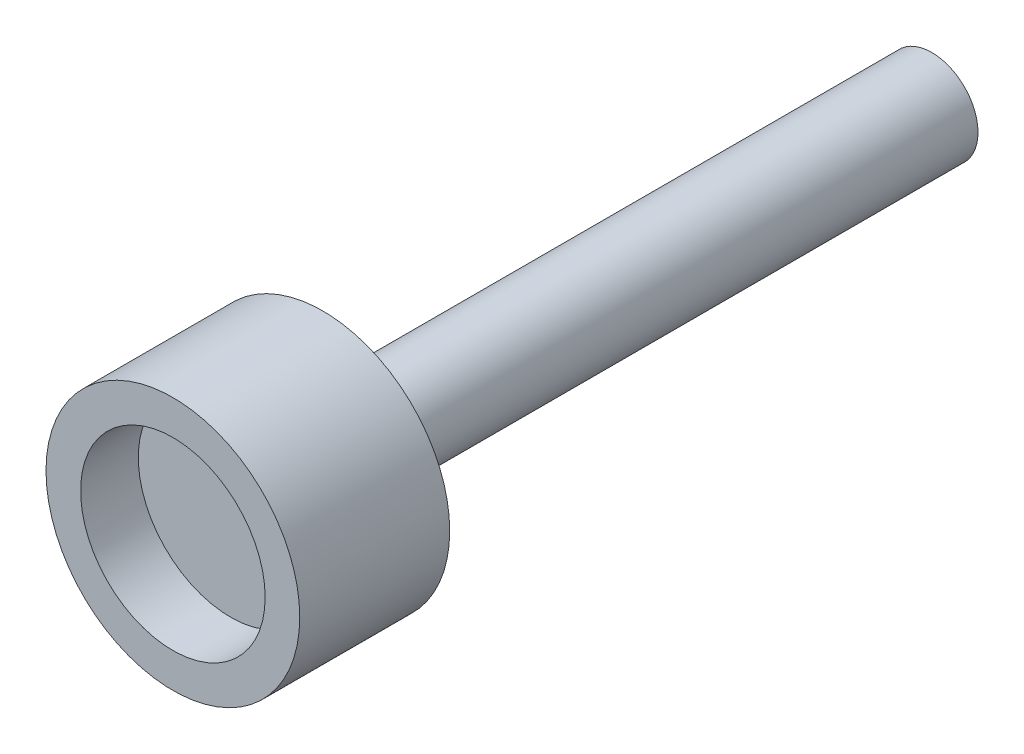
ISO-10303-21;
HEADER;
FILE_DESCRIPTION(('STEP AP214'),'2;1');
FILE_NAME('part.step','',(''),(''),'','','');
FILE_SCHEMA(('AUTOMOTIVE_DESIGN { 1 0 10303 214 1 1 1 1 }'));
ENDSEC;
DATA;
#1=APPLICATION_CONTEXT('core data for automotive mechanical design processes');
#2=APPLICATION_PROTOCOL_DEFINITION('international standard','automotive_design',2000,#1);
#3=PRODUCT_CONTEXT('',#1,'mechanical');
#4=PRODUCT('Part','Part','',(#3));
#5=PRODUCT_RELATED_PRODUCT_CATEGORY('part','',(#4));
#6=PRODUCT_DEFINITION_FORMATION('','',#4);
#7=PRODUCT_DEFINITION_CONTEXT('part definition',#1,'design');
#8=PRODUCT_DEFINITION('design','',#6,#7);
#9=PRODUCT_DEFINITION_SHAPE('','',#8);
#10=(LENGTH_UNIT() NAMED_UNIT(*) SI_UNIT(.MILLI.,.METRE.));
#11=(NAMED_UNIT(*) PLANE_ANGLE_UNIT() SI_UNIT($,.RADIAN.));
#12=(NAMED_UNIT(*) SI_UNIT($,.STERADIAN.) SOLID_ANGLE_UNIT());
#13=UNCERTAINTY_MEASURE_WITH_UNIT(LENGTH_MEASURE(1.E-05),#10,'distance_accuracy_value','');
#14=(GEOMETRIC_REPRESENTATION_CONTEXT(3) GLOBAL_UNCERTAINTY_ASSIGNED_CONTEXT((#13)) GLOBAL_UNIT_ASSIGNED_CONTEXT((#10,
#11,#12)) REPRESENTATION_CONTEXT('',''));
#15=CARTESIAN_POINT('',(0.,0.,0.));
#16=DIRECTION('',(0.,0.,1.));
#17=DIRECTION('',(1.,0.,0.));
#18=AXIS2_PLACEMENT_3D('',#15,#16,#17);
#19=CARTESIAN_POINT('',(0.,0.,13.));
#20=DIRECTION('',(0.,0.,-1.));
#21=DIRECTION('',(-1.,0.,0.));
#22=AXIS2_PLACEMENT_3D('',#19,#20,#21);
#23=CYLINDRICAL_SURFACE('',#22,11.);
#24=CARTESIAN_POINT('',(-11.,0.,6.5));
#25=CARTESIAN_POINT('',(-10.9999987467262,-0.0838384134298606,6.49999648054262));
#26=CARTESIAN_POINT('',(-10.9990314271488,-0.167727602289746,6.49294740732744));
#27=CARTESIAN_POINT('',(-10.9952656640845,-0.333167097641412,6.46494111677571));
#28=CARTESIAN_POINT('',(-10.992465364401,-0.414714945659857,6.44396980055016));
#29=CARTESIAN_POINT('',(-10.9853487739829,-0.573053093693593,6.38875226615938));
#30=CARTESIAN_POINT('',(-10.9810335583919,-0.649846722453226,6.35451546079792));
#31=CARTESIAN_POINT('',(-10.971365727223,-0.796585302449729,6.27376047543979));
#32=CARTESIAN_POINT('',(-10.9660132749006,-0.866531328858719,6.22724422774571));
#33=CARTESIAN_POINT('',(-10.9548285996925,-0.998057563812247,6.12292778570769));
#34=CARTESIAN_POINT('',(-10.9489937690522,-1.05958678462377,6.06506357699654));
#35=CARTESIAN_POINT('',(-10.9375227155932,-1.17209333908044,5.93983138920761));
#36=CARTESIAN_POINT('',(-10.9318865034525,-1.22307010612799,5.87246290013868));
#37=CARTESIAN_POINT('',(-10.9214253777188,-1.31321850524923,5.72979806177589));
#38=CARTESIAN_POINT('',(-10.916603830108,-1.35234166468403,5.65447081499478));
#39=CARTESIAN_POINT('',(-10.9083529406776,-1.41736264485278,5.49823818462633));
#40=CARTESIAN_POINT('',(-10.904923536173,-1.44326106107985,5.4173330523902));
#41=CARTESIAN_POINT('',(-10.8998704969217,-1.4809409055509,5.25277375642641));
#42=CARTESIAN_POINT('',(-10.8982357822449,-1.49280898864549,5.16913978070894));
#43=CARTESIAN_POINT('',(-10.8969234380482,-1.50235955059667,5.00105252697592));
#44=CARTESIAN_POINT('',(-10.8972457153308,-1.50004270497976,4.91659928816724));
#45=CARTESIAN_POINT('',(-10.8998008033656,-1.4813601701924,4.7498782743991));
#46=CARTESIAN_POINT('',(-10.9020205710196,-1.4650903891759,4.66759952363282));
#47=CARTESIAN_POINT('',(-10.9081001740818,-1.419113676953,4.50695095946735));
#48=CARTESIAN_POINT('',(-10.911960048455,-1.38940642650253,4.42858123898703));
#49=CARTESIAN_POINT('',(-10.920899582937,-1.31729641760207,4.27768007396238));
#50=CARTESIAN_POINT('',(-10.9259831927575,-1.27485243857761,4.20516857073199));
#51=CARTESIAN_POINT('',(-10.9367944433469,-1.1785032304482,4.06826085111422));
#52=CARTESIAN_POINT('',(-10.9425221191218,-1.12459737823041,4.00386507623326));
#53=CARTESIAN_POINT('',(-10.954033973898,-1.006325277838,3.88446044550542));
#54=CARTESIAN_POINT('',(-10.9598182294108,-0.941876450734227,3.82953335968757));
#55=CARTESIAN_POINT('',(-10.9707474705779,-0.804630944405408,3.73126350840162));
#56=CARTESIAN_POINT('',(-10.9758924542398,-0.731834239164638,3.68792077903695));
#57=CARTESIAN_POINT('',(-10.9849675408771,-0.579892969480448,3.61404813681997));
#58=CARTESIAN_POINT('',(-10.9888971094847,-0.500745632131287,3.58352385760728));
#59=CARTESIAN_POINT('',(-10.9950939520307,-0.338383087939893,3.5362221620544));
#60=CARTESIAN_POINT('',(-10.997361318692,-0.255168108280129,3.51944397890651));
#61=CARTESIAN_POINT('',(-10.9999661380375,-0.087738907367672,3.50021791543442));
#62=CARTESIAN_POINT('',(-11.0003187469014,-0.00353783638784332,3.49765749141139));
#63=CARTESIAN_POINT('',(-10.9990953877098,0.164092294089254,3.50664187833073));
#64=CARTESIAN_POINT('',(-10.9975194687383,0.247521373180419,3.51818633028291));
#65=CARTESIAN_POINT('',(-10.9926255265792,0.410903378364947,3.55495922320966));
#66=CARTESIAN_POINT('',(-10.9893144012332,0.490868720620559,3.58013349557132));
#67=CARTESIAN_POINT('',(-10.9813204406364,0.645443141095587,3.64339475903291));
#68=CARTESIAN_POINT('',(-10.9766375509031,0.720052006425215,3.68148226301717));
#69=CARTESIAN_POINT('',(-10.9663836303603,0.86229489298246,3.76975753872403));
#70=CARTESIAN_POINT('',(-10.960807370571,0.929883728353245,3.82001750280037));
#71=CARTESIAN_POINT('',(-10.9494055314268,1.05570701325461,3.93110957795735));
#72=CARTESIAN_POINT('',(-10.9435799402192,1.11394101745332,3.99194219205667));
#73=CARTESIAN_POINT('',(-10.9322886877303,1.21980532954113,4.12295083300841));
#74=CARTESIAN_POINT('',(-10.9268257501214,1.26736066380642,4.19318771348107));
#75=CARTESIAN_POINT('',(-10.9169246504416,1.34999839549265,4.34071830769977));
#76=CARTESIAN_POINT('',(-10.9124864646235,1.38508108196142,4.41801185785858));
#77=CARTESIAN_POINT('',(-10.9051564726067,1.44165849505153,4.57722775667319));
#78=CARTESIAN_POINT('',(-10.902259998972,1.46319427050013,4.65913529443613));
#79=CARTESIAN_POINT('',(-10.8983284316023,1.49219810547518,4.82544652182804));
#80=CARTESIAN_POINT('',(-10.8972932333409,1.499666954979,4.90985007101435));
#81=CARTESIAN_POINT('',(-10.8972048541528,1.50030856584718,5.07801097539096));
#82=CARTESIAN_POINT('',(-10.8981353386205,1.49359914690637,5.1617678966084));
#83=CARTESIAN_POINT('',(-10.9018382005365,1.46632546438533,5.32695113869849));
#84=CARTESIAN_POINT('',(-10.9046105769335,1.44576120871189,5.40837746090115));
#85=CARTESIAN_POINT('',(-10.9116795081979,1.3914005645048,5.56656513938514));
#86=CARTESIAN_POINT('',(-10.9159752803929,1.35761096980691,5.64332886748253));
#87=CARTESIAN_POINT('',(-10.925608111245,1.2777703983912,5.79011629860636));
#88=CARTESIAN_POINT('',(-10.9309451926623,1.23171915365824,5.86013985426055));
#89=CARTESIAN_POINT('',(-10.9421122992185,1.12822915223083,5.99206003659979));
#90=CARTESIAN_POINT('',(-10.9479459056036,1.07070278423403,6.05388763622251));
#91=CARTESIAN_POINT('',(-10.9594178730356,0.946079868053621,6.16705534671078));
#92=CARTESIAN_POINT('',(-10.9650561880416,0.878981081957848,6.21839299831137));
#93=CARTESIAN_POINT('',(-10.9755309296992,0.736765493201997,6.30932596738336));
#94=CARTESIAN_POINT('',(-10.9803636164562,0.661613818517361,6.34886715827632));
#95=CARTESIAN_POINT('',(-10.9886453705716,0.505709693930314,6.41470948105298));
#96=CARTESIAN_POINT('',(-10.9920959102772,0.424963312021876,6.4410247096937));
#97=CARTESIAN_POINT('',(-10.9964117606731,0.286518597087189,6.47351043706394));
#98=CARTESIAN_POINT('',(-10.9977506427886,0.229685788696072,6.48342936079734));
#99=CARTESIAN_POINT('',(-10.9995451890738,0.115243313646887,6.49667532098121));
#100=CARTESIAN_POINT('',(-11.0000008615472,0.0576336542977,6.50000241940635));
#101=CARTESIAN_POINT('',(-11.,0.,6.5));
#102=B_SPLINE_CURVE_WITH_KNOTS('',3,(#24,#25,#26,#27,#28,#29,#30,#31,#32,#33,#34,#35,#36,#37,
#38,#39,#40,#41,#42,#43,#44,#45,#46,#47,#48,#49,#50,#51,#52,#53,#54,#55,#56,#57,#58,#59,#60,#61,
#62,#63,#64,#65,#66,#67,#68,#69,#70,#71,#72,#73,#74,#75,#76,#77,#78,#79,#80,#81,#82,#83,#84,#85,
#86,#87,#88,#89,#90,#91,#92,#93,#94,#95,#96,#97,#98,#99,#100,#101),.UNSPECIFIED.,.T.,.F.,(4,2,2,
2,2,2,2,2,2,2,2,2,2,2,2,2,2,2,2,2,2,2,2,2,2,2,2,2,2,2,2,2,2,2,2,2,2,2,4),(0.,0.25130468808615,
0.502864258429492,0.754245655375318,1.00558751830525,1.25839025869503,1.51120656941612,
1.76504317927172,2.01886835818389,2.27111752000617,2.52335466910192,2.77387178872724,
3.02439486038875,3.27573762185034,3.52709405079554,3.7805228474684,4.03395243396009,
4.28749328511462,4.54101999186671,4.79253696204824,5.04404753088009,5.29456578809543,
5.54509399649482,5.79714607697892,6.04921015271754,6.30299215129408,6.55676826820729,
6.80977166004952,7.0627608431786,7.3136559874506,7.56455098853992,7.81531727406241,
8.0660890412842,8.31885423544369,8.5716786200941,8.82564582024677,9.07934175494259,
9.25209960062623,9.42485582207674),.UNSPECIFIED.);
#103=CARTESIAN_POINT('',(-11.,0.,6.5));
#104=VERTEX_POINT('',#103);
#105=EDGE_CURVE('E52',#104,#104,#102,.T.);
#106=ORIENTED_EDGE('',*,*,#105,.T.);
#107=EDGE_LOOP('',(#106));
#108=FACE_BOUND('',#107,.T.);
#109=CARTESIAN_POINT('',(0.,0.,13.));
#110=DIRECTION('',(0.,0.,1.));
#111=DIRECTION('',(1.,0.,0.));
#112=AXIS2_PLACEMENT_3D('',#109,#110,#111);
#113=CIRCLE('',#112,11.);
#114=CARTESIAN_POINT('',(11.,0.,13.));
#115=VERTEX_POINT('',#114);
#116=EDGE_CURVE('E38',#115,#115,#113,.T.);
#117=ORIENTED_EDGE('',*,*,#116,.F.);
#118=EDGE_LOOP('',(#117));
#119=FACE_BOUND('',#118,.T.);
#120=CARTESIAN_POINT('',(0.,0.,0.));
#121=DIRECTION('',(0.,0.,1.));
#122=DIRECTION('',(1.,0.,0.));
#123=AXIS2_PLACEMENT_3D('',#120,#121,#122);
#124=CIRCLE('',#123,11.);
#125=CARTESIAN_POINT('',(11.,0.,0.));
#126=VERTEX_POINT('',#125);
#127=EDGE_CURVE('E42',#126,#126,#124,.T.);
#128=ORIENTED_EDGE('',*,*,#127,.T.);
#129=EDGE_LOOP('',(#128));
#130=FACE_BOUND('',#129,.T.);
#131=ADVANCED_FACE('F31',(#108,#119,#130),#23,.T.);
#132=CARTESIAN_POINT('',(0.,0.,13.));
#133=DIRECTION('',(0.,0.,1.));
#134=DIRECTION('',(1.,0.,0.));
#135=AXIS2_PLACEMENT_3D('',#132,#133,#134);
#136=PLANE('',#135);
#137=CARTESIAN_POINT('',(0.,0.,13.));
#138=DIRECTION('',(0.,0.,1.));
#139=DIRECTION('',(1.,0.,0.));
#140=AXIS2_PLACEMENT_3D('',#137,#138,#139);
#141=CIRCLE('',#140,8.);
#142=CARTESIAN_POINT('',(8.,0.,13.));
#143=VERTEX_POINT('',#142);
#144=EDGE_CURVE('E50',#143,#143,#141,.T.);
#145=ORIENTED_EDGE('',*,*,#144,.F.);
#146=EDGE_LOOP('',(#145));
#147=FACE_BOUND('',#146,.T.);
#148=ORIENTED_EDGE('',*,*,#116,.T.);
#149=EDGE_LOOP('',(#148));
#150=FACE_BOUND('',#149,.T.);
#151=ADVANCED_FACE('F75',(#147,#150),#136,.T.);
#152=CARTESIAN_POINT('',(0.,0.,0.));
#153=DIRECTION('',(0.,0.,1.));
#154=DIRECTION('',(1.,0.,0.));
#155=AXIS2_PLACEMENT_3D('',#152,#153,#154);
#156=PLANE('',#155);
#157=CARTESIAN_POINT('',(0.,0.,0.));
#158=DIRECTION('',(0.,0.,1.));
#159=DIRECTION('',(1.,0.,0.));
#160=AXIS2_PLACEMENT_3D('',#157,#158,#159);
#161=CIRCLE('',#160,4.);
#162=CARTESIAN_POINT('',(4.,0.,0.));
#163=VERTEX_POINT('',#162);
#164=EDGE_CURVE('E10',#163,#163,#161,.F.);
#165=ORIENTED_EDGE('',*,*,#164,.F.);
#166=EDGE_LOOP('',(#165));
#167=FACE_BOUND('',#166,.T.);
#168=ORIENTED_EDGE('',*,*,#127,.F.);
#169=EDGE_LOOP('',(#168));
#170=FACE_BOUND('',#169,.T.);
#171=ADVANCED_FACE('F73',(#167,#170),#156,.F.);
#172=CARTESIAN_POINT('',(0.,0.,8.));
#173=DIRECTION('',(0.,0.,1.));
#174=DIRECTION('',(1.,0.,0.));
#175=AXIS2_PLACEMENT_3D('',#172,#173,#174);
#176=CYLINDRICAL_SURFACE('',#175,8.);
#177=CARTESIAN_POINT('',(0.,0.,8.));
#178=DIRECTION('',(0.,0.,1.));
#179=DIRECTION('',(1.,0.,0.));
#180=AXIS2_PLACEMENT_3D('',#177,#178,#179);
#181=CIRCLE('',#180,8.);
#182=CARTESIAN_POINT('',(8.,0.,8.));
#183=VERTEX_POINT('',#182);
#184=EDGE_CURVE('E47',#183,#183,#181,.T.);
#185=ORIENTED_EDGE('',*,*,#184,.F.);
#186=EDGE_LOOP('',(#185));
#187=FACE_BOUND('',#186,.T.);
#188=ORIENTED_EDGE('',*,*,#144,.T.);
#189=EDGE_LOOP('',(#188));
#190=FACE_BOUND('',#189,.T.);
#191=ADVANCED_FACE('F69',(#187,#190),#176,.F.);
#192=CARTESIAN_POINT('',(0.,0.,8.));
#193=DIRECTION('',(0.,0.,1.));
#194=DIRECTION('',(1.,0.,0.));
#195=AXIS2_PLACEMENT_3D('',#192,#193,#194);
#196=PLANE('',#195);
#197=ORIENTED_EDGE('',*,*,#184,.T.);
#198=EDGE_LOOP('',(#197));
#199=FACE_BOUND('',#198,.T.);
#200=ADVANCED_FACE('F64',(#199),#196,.T.);
#201=CARTESIAN_POINT('',(-15.,0.,5.));
#202=DIRECTION('',(1.,0.,0.));
#203=DIRECTION('',(0.,0.,-1.));
#204=AXIS2_PLACEMENT_3D('',#201,#202,#203);
#205=CYLINDRICAL_SURFACE('',#204,1.5);
#206=CARTESIAN_POINT('',(0.,0.,5.));
#207=DIRECTION('',(1.,0.,0.));
#208=DIRECTION('',(0.,0.,-1.));
#209=AXIS2_PLACEMENT_3D('',#206,#207,#208);
#210=CIRCLE('',#209,1.5);
#211=CARTESIAN_POINT('',(0.,0.,3.5));
#212=VERTEX_POINT('',#211);
#213=EDGE_CURVE('E57',#212,#212,#210,.T.);
#214=ORIENTED_EDGE('',*,*,#213,.T.);
#215=EDGE_LOOP('',(#214));
#216=FACE_BOUND('',#215,.T.);
#217=ORIENTED_EDGE('',*,*,#105,.F.);
#218=EDGE_LOOP('',(#217));
#219=FACE_BOUND('',#218,.T.);
#220=ADVANCED_FACE('F58',(#216,#219),#205,.F.);
#221=CARTESIAN_POINT('',(0.,0.,5.));
#222=DIRECTION('',(1.,0.,0.));
#223=DIRECTION('',(0.,0.,-1.));
#224=AXIS2_PLACEMENT_3D('',#221,#222,#223);
#225=PLANE('',#224);
#226=ORIENTED_EDGE('',*,*,#213,.F.);
#227=EDGE_LOOP('',(#226));
#228=FACE_BOUND('',#227,.T.);
#229=ADVANCED_FACE('F63',(#228),#225,.F.);
#230=CARTESIAN_POINT('',(0.,0.,-52.8));
#231=DIRECTION('',(0.,0.,1.));
#232=DIRECTION('',(1.,0.,0.));
#233=AXIS2_PLACEMENT_3D('',#230,#231,#232);
#234=CYLINDRICAL_SURFACE('',#233,4.);
#235=CARTESIAN_POINT('',(0.,0.,-52.8));
#236=DIRECTION('',(0.,0.,-1.));
#237=DIRECTION('',(-1.,0.,0.));
#238=AXIS2_PLACEMENT_3D('',#235,#236,#237);
#239=CIRCLE('',#238,4.);
#240=CARTESIAN_POINT('',(-4.,0.,-52.8));
#241=VERTEX_POINT('',#240);
#242=EDGE_CURVE('E148',#241,#241,#239,.T.);
#243=ORIENTED_EDGE('',*,*,#242,.F.);
#244=EDGE_LOOP('',(#243));
#245=FACE_BOUND('',#244,.T.);
#246=ORIENTED_EDGE('',*,*,#164,.T.);
#247=EDGE_LOOP('',(#246));
#248=FACE_BOUND('',#247,.T.);
#249=ADVANCED_FACE('F121',(#245,#248),#234,.T.);
#250=CARTESIAN_POINT('',(0.,0.,-52.8));
#251=DIRECTION('',(0.,0.,-1.));
#252=DIRECTION('',(-1.,0.,0.));
#253=AXIS2_PLACEMENT_3D('',#250,#251,#252);
#254=PLANE('',#253);
#255=ORIENTED_EDGE('',*,*,#242,.T.);
#256=EDGE_LOOP('',(#255));
#257=FACE_BOUND('',#256,.T.);
#258=ADVANCED_FACE('F128',(#257),#254,.T.);
#259=CLOSED_SHELL('',(#131,#151,#171,#191,#200,#220,#229,#249,#258));
#260=MANIFOLD_SOLID_BREP('B2',#259);
#261=ADVANCED_BREP_SHAPE_REPRESENTATION('',(#18,#260),#14);
#262=SHAPE_DEFINITION_REPRESENTATION(#9,#261);
ENDSEC;
END-ISO-10303-21;
